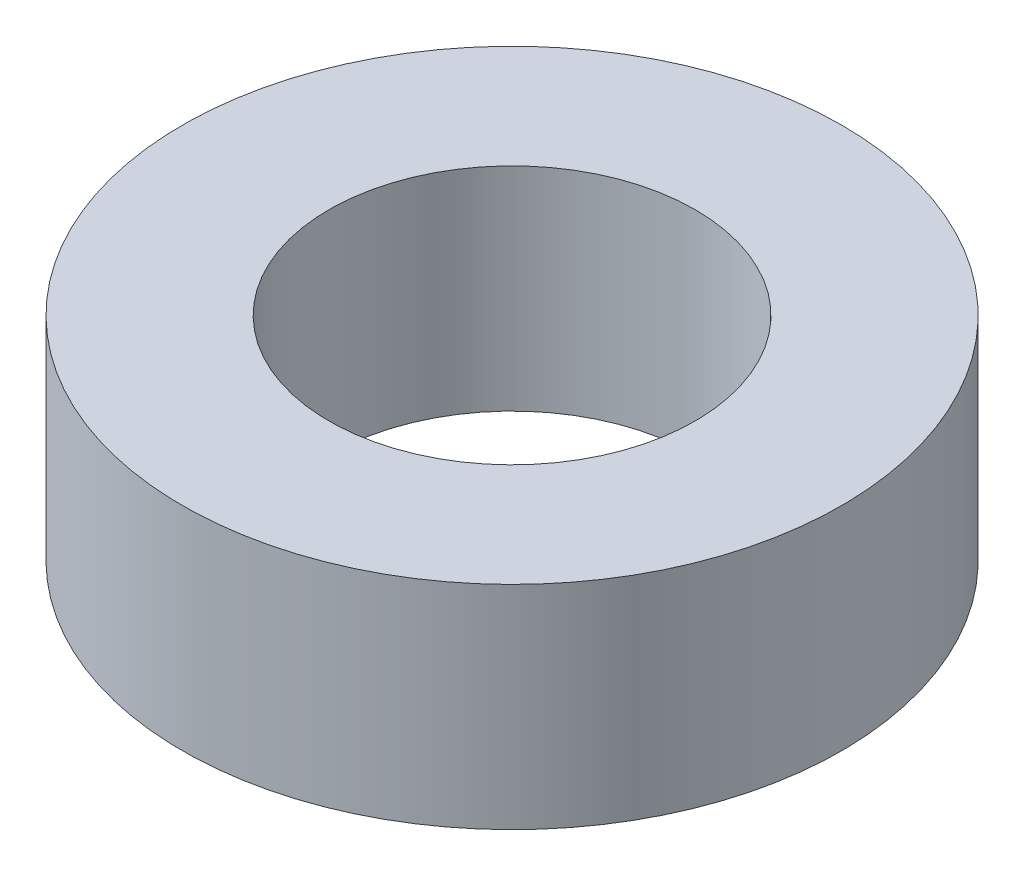
ISO-10303-21;
HEADER;
FILE_DESCRIPTION(('STEP AP214'),'2;1');
FILE_NAME('part.step','',(''),(''),'','','');
FILE_SCHEMA(('AUTOMOTIVE_DESIGN { 1 0 10303 214 1 1 1 1 }'));
ENDSEC;
DATA;
#1=APPLICATION_CONTEXT('core data for automotive mechanical design processes');
#2=APPLICATION_PROTOCOL_DEFINITION('international standard','automotive_design',2000,#1);
#3=PRODUCT_CONTEXT('',#1,'mechanical');
#4=PRODUCT('Part','Part','',(#3));
#5=PRODUCT_RELATED_PRODUCT_CATEGORY('part','',(#4));
#6=PRODUCT_DEFINITION_FORMATION('','',#4);
#7=PRODUCT_DEFINITION_CONTEXT('part definition',#1,'design');
#8=PRODUCT_DEFINITION('design','',#6,#7);
#9=PRODUCT_DEFINITION_SHAPE('','',#8);
#10=(LENGTH_UNIT() NAMED_UNIT(*) SI_UNIT(.MILLI.,.METRE.));
#11=(NAMED_UNIT(*) PLANE_ANGLE_UNIT() SI_UNIT($,.RADIAN.));
#12=(NAMED_UNIT(*) SI_UNIT($,.STERADIAN.) SOLID_ANGLE_UNIT());
#13=UNCERTAINTY_MEASURE_WITH_UNIT(LENGTH_MEASURE(1.E-05),#10,'distance_accuracy_value','');
#14=(GEOMETRIC_REPRESENTATION_CONTEXT(3) GLOBAL_UNCERTAINTY_ASSIGNED_CONTEXT((#13)) GLOBAL_UNIT_ASSIGNED_CONTEXT((#10,
#11,#12)) REPRESENTATION_CONTEXT('',''));
#15=CARTESIAN_POINT('',(0.,0.,0.));
#16=DIRECTION('',(0.,0.,1.));
#17=DIRECTION('',(1.,0.,0.));
#18=AXIS2_PLACEMENT_3D('',#15,#16,#17);
#19=CARTESIAN_POINT('',(0.,29.,0.));
#20=DIRECTION('',(0.,-1.,0.));
#21=DIRECTION('',(0.,0.,-1.));
#22=AXIS2_PLACEMENT_3D('',#19,#20,#21);
#23=CYLINDRICAL_SURFACE('',#22,45.);
#24=CARTESIAN_POINT('',(0.,29.,0.));
#25=DIRECTION('',(0.,1.,0.));
#26=DIRECTION('',(0.,0.,1.));
#27=AXIS2_PLACEMENT_3D('',#24,#25,#26);
#28=CIRCLE('',#27,45.);
#29=CARTESIAN_POINT('',(0.,29.,-45.));
#30=VERTEX_POINT('',#29);
#31=EDGE_CURVE('E10',#30,#30,#28,.T.);
#32=CARTESIAN_POINT('',(0.,0.,0.));
#33=DIRECTION('',(0.,1.,0.));
#34=DIRECTION('',(0.,0.,1.));
#35=AXIS2_PLACEMENT_3D('',#32,#33,#34);
#36=CIRCLE('',#35,45.);
#37=CARTESIAN_POINT('',(0.,0.,-45.));
#38=VERTEX_POINT('',#37);
#39=EDGE_CURVE('E37',#38,#38,#36,.T.);
#40=CARTESIAN_POINT('',(0.,29.,-45.));
#41=CARTESIAN_POINT('',(0.,28.6979166666667,-45.));
#42=CARTESIAN_POINT('',(0.,28.3958333333333,-45.));
#43=CARTESIAN_POINT('',(0.,27.7916666666667,-45.));
#44=CARTESIAN_POINT('',(0.,27.4895833333333,-45.));
#45=CARTESIAN_POINT('',(0.,26.8854166666667,-45.));
#46=CARTESIAN_POINT('',(0.,26.5833333333333,-45.));
#47=CARTESIAN_POINT('',(0.,25.9791666666667,-45.));
#48=CARTESIAN_POINT('',(0.,25.6770833333333,-45.));
#49=CARTESIAN_POINT('',(0.,25.0729166666667,-45.));
#50=CARTESIAN_POINT('',(0.,24.7708333333333,-45.));
#51=CARTESIAN_POINT('',(0.,24.1666666666667,-45.));
#52=CARTESIAN_POINT('',(0.,23.8645833333333,-45.));
#53=CARTESIAN_POINT('',(0.,23.2604166666667,-45.));
#54=CARTESIAN_POINT('',(0.,22.9583333333333,-45.));
#55=CARTESIAN_POINT('',(0.,22.3541666666667,-45.));
#56=CARTESIAN_POINT('',(0.,22.0520833333333,-45.));
#57=CARTESIAN_POINT('',(0.,21.4479166666667,-45.));
#58=CARTESIAN_POINT('',(0.,21.1458333333333,-45.));
#59=CARTESIAN_POINT('',(0.,20.5416666666667,-45.));
#60=CARTESIAN_POINT('',(0.,20.2395833333333,-45.));
#61=CARTESIAN_POINT('',(0.,19.6354166666667,-45.));
#62=CARTESIAN_POINT('',(0.,19.3333333333333,-45.));
#63=CARTESIAN_POINT('',(0.,18.7291666666667,-45.));
#64=CARTESIAN_POINT('',(0.,18.4270833333333,-45.));
#65=CARTESIAN_POINT('',(0.,17.8229166666667,-45.));
#66=CARTESIAN_POINT('',(0.,17.5208333333333,-45.));
#67=CARTESIAN_POINT('',(0.,16.9166666666667,-45.));
#68=CARTESIAN_POINT('',(0.,16.6145833333333,-45.));
#69=CARTESIAN_POINT('',(0.,16.0104166666667,-45.));
#70=CARTESIAN_POINT('',(0.,15.7083333333333,-45.));
#71=CARTESIAN_POINT('',(0.,15.1041666666667,-45.));
#72=CARTESIAN_POINT('',(0.,14.8020833333333,-45.));
#73=CARTESIAN_POINT('',(0.,14.1979166666667,-45.));
#74=CARTESIAN_POINT('',(0.,13.8958333333333,-45.));
#75=CARTESIAN_POINT('',(0.,13.2916666666667,-45.));
#76=CARTESIAN_POINT('',(0.,12.9895833333333,-45.));
#77=CARTESIAN_POINT('',(0.,12.3854166666667,-45.));
#78=CARTESIAN_POINT('',(0.,12.0833333333333,-45.));
#79=CARTESIAN_POINT('',(0.,11.4791666666667,-45.));
#80=CARTESIAN_POINT('',(0.,11.1770833333333,-45.));
#81=CARTESIAN_POINT('',(0.,10.5729166666667,-45.));
#82=CARTESIAN_POINT('',(0.,10.2708333333333,-45.));
#83=CARTESIAN_POINT('',(0.,9.66666666666667,-45.));
#84=CARTESIAN_POINT('',(0.,9.36458333333333,-45.));
#85=CARTESIAN_POINT('',(0.,8.76041666666667,-45.));
#86=CARTESIAN_POINT('',(0.,8.45833333333333,-45.));
#87=CARTESIAN_POINT('',(0.,7.85416666666667,-45.));
#88=CARTESIAN_POINT('',(0.,7.55208333333333,-45.));
#89=CARTESIAN_POINT('',(0.,6.94791666666667,-45.));
#90=CARTESIAN_POINT('',(0.,6.64583333333333,-45.));
#91=CARTESIAN_POINT('',(0.,6.04166666666667,-45.));
#92=CARTESIAN_POINT('',(0.,5.73958333333333,-45.));
#93=CARTESIAN_POINT('',(0.,5.13541666666667,-45.));
#94=CARTESIAN_POINT('',(0.,4.83333333333333,-45.));
#95=CARTESIAN_POINT('',(0.,4.22916666666667,-45.));
#96=CARTESIAN_POINT('',(0.,3.92708333333333,-45.));
#97=CARTESIAN_POINT('',(0.,3.32291666666667,-45.));
#98=CARTESIAN_POINT('',(0.,3.02083333333333,-45.));
#99=CARTESIAN_POINT('',(0.,2.41666666666667,-45.));
#100=CARTESIAN_POINT('',(0.,2.11458333333333,-45.));
#101=CARTESIAN_POINT('',(0.,1.51041666666667,-45.));
#102=CARTESIAN_POINT('',(0.,1.20833333333333,-45.));
#103=CARTESIAN_POINT('',(0.,0.604166666666667,-45.));
#104=CARTESIAN_POINT('',(0.,0.302083333333333,-45.));
#105=CARTESIAN_POINT('',(0.,0.,-45.));
#106=B_SPLINE_CURVE_WITH_KNOTS('',3,(#40,#41,#42,#43,#44,#45,#46,#47,#48,#49,#50,#51,#52,#53,
#54,#55,#56,#57,#58,#59,#60,#61,#62,#63,#64,#65,#66,#67,#68,#69,#70,#71,#72,#73,#74,#75,#76,#77,
#78,#79,#80,#81,#82,#83,#84,#85,#86,#87,#88,#89,#90,#91,#92,#93,#94,#95,#96,#97,#98,#99,#100,
#101,#102,#103,#104,#105),.UNSPECIFIED.,.F.,.F.,(4,2,2,2,2,2,2,2,2,2,2,2,2,2,2,2,2,2,2,2,2,2,2,
2,2,2,2,2,2,2,2,2,4),(0.,0.906249999999997,1.8125,2.71875,3.625,4.53125,5.4375,6.34375,7.25,
8.15625,9.0625,9.96875,10.875,11.78125,12.6875,13.59375,14.5,15.40625,16.3125,17.21875,18.125,
19.03125,19.9375,20.84375,21.75,22.65625,23.5625,24.46875,25.375,26.28125,27.1875,28.09375,29.),.UNSPECIFIED.);
#107=EDGE_CURVE('BSEAM40',#30,#38,#106,.T.);
#108=ORIENTED_EDGE('',*,*,#31,.F.);
#109=ORIENTED_EDGE('',*,*,#39,.T.);
#110=ORIENTED_EDGE('',*,*,#107,.T.);
#111=ORIENTED_EDGE('',*,*,#107,.F.);
#112=EDGE_LOOP('',(#108,#110,#109,#111));
#113=FACE_BOUND('',#112,.T.);
#114=ADVANCED_FACE('F40',(#113),#23,.T.);
#115=CARTESIAN_POINT('',(0.,29.,0.));
#116=DIRECTION('',(0.,1.,0.));
#117=DIRECTION('',(0.,0.,1.));
#118=AXIS2_PLACEMENT_3D('',#115,#116,#117);
#119=PLANE('',#118);
#120=CARTESIAN_POINT('',(0.,29.,0.));
#121=DIRECTION('',(0.,1.,0.));
#122=DIRECTION('',(0.,0.,1.));
#123=AXIS2_PLACEMENT_3D('',#120,#121,#122);
#124=CIRCLE('',#123,25.);
#125=CARTESIAN_POINT('',(0.,29.,-25.));
#126=VERTEX_POINT('',#125);
#127=EDGE_CURVE('E50',#126,#126,#124,.T.);
#128=ORIENTED_EDGE('',*,*,#127,.F.);
#129=EDGE_LOOP('',(#128));
#130=FACE_BOUND('',#129,.T.);
#131=ORIENTED_EDGE('',*,*,#31,.T.);
#132=EDGE_LOOP('',(#131));
#133=FACE_BOUND('',#132,.T.);
#134=ADVANCED_FACE('F59',(#130,#133),#119,.T.);
#135=CARTESIAN_POINT('',(0.,0.,0.));
#136=DIRECTION('',(0.,1.,0.));
#137=DIRECTION('',(0.,0.,1.));
#138=AXIS2_PLACEMENT_3D('',#135,#136,#137);
#139=PLANE('',#138);
#140=CARTESIAN_POINT('',(0.,0.,0.));
#141=DIRECTION('',(0.,1.,0.));
#142=DIRECTION('',(0.,0.,1.));
#143=AXIS2_PLACEMENT_3D('',#140,#141,#142);
#144=CIRCLE('',#143,25.);
#145=CARTESIAN_POINT('',(0.,0.,-25.));
#146=VERTEX_POINT('',#145);
#147=EDGE_CURVE('E47',#146,#146,#144,.T.);
#148=ORIENTED_EDGE('',*,*,#147,.T.);
#149=EDGE_LOOP('',(#148));
#150=FACE_BOUND('',#149,.T.);
#151=ORIENTED_EDGE('',*,*,#39,.F.);
#152=EDGE_LOOP('',(#151));
#153=FACE_BOUND('',#152,.T.);
#154=ADVANCED_FACE('F58',(#150,#153),#139,.F.);
#155=CARTESIAN_POINT('',(0.,29.,0.));
#156=DIRECTION('',(0.,-1.,0.));
#157=DIRECTION('',(0.,0.,-1.));
#158=AXIS2_PLACEMENT_3D('',#155,#156,#157);
#159=CYLINDRICAL_SURFACE('',#158,25.);
#160=CARTESIAN_POINT('',(0.,29.,-25.));
#161=CARTESIAN_POINT('',(0.,28.6979166666667,-25.));
#162=CARTESIAN_POINT('',(0.,28.3958333333333,-25.));
#163=CARTESIAN_POINT('',(0.,27.7916666666667,-25.));
#164=CARTESIAN_POINT('',(0.,27.4895833333333,-25.));
#165=CARTESIAN_POINT('',(0.,26.8854166666667,-25.));
#166=CARTESIAN_POINT('',(0.,26.5833333333333,-25.));
#167=CARTESIAN_POINT('',(0.,25.9791666666667,-25.));
#168=CARTESIAN_POINT('',(0.,25.6770833333333,-25.));
#169=CARTESIAN_POINT('',(0.,25.0729166666667,-25.));
#170=CARTESIAN_POINT('',(0.,24.7708333333333,-25.));
#171=CARTESIAN_POINT('',(0.,24.1666666666667,-25.));
#172=CARTESIAN_POINT('',(0.,23.8645833333333,-25.));
#173=CARTESIAN_POINT('',(0.,23.2604166666667,-25.));
#174=CARTESIAN_POINT('',(0.,22.9583333333333,-25.));
#175=CARTESIAN_POINT('',(0.,22.3541666666667,-25.));
#176=CARTESIAN_POINT('',(0.,22.0520833333333,-25.));
#177=CARTESIAN_POINT('',(0.,21.4479166666667,-25.));
#178=CARTESIAN_POINT('',(0.,21.1458333333333,-25.));
#179=CARTESIAN_POINT('',(0.,20.5416666666667,-25.));
#180=CARTESIAN_POINT('',(0.,20.2395833333333,-25.));
#181=CARTESIAN_POINT('',(0.,19.6354166666667,-25.));
#182=CARTESIAN_POINT('',(0.,19.3333333333333,-25.));
#183=CARTESIAN_POINT('',(0.,18.7291666666667,-25.));
#184=CARTESIAN_POINT('',(0.,18.4270833333333,-25.));
#185=CARTESIAN_POINT('',(0.,17.8229166666667,-25.));
#186=CARTESIAN_POINT('',(0.,17.5208333333333,-25.));
#187=CARTESIAN_POINT('',(0.,16.9166666666667,-25.));
#188=CARTESIAN_POINT('',(0.,16.6145833333333,-25.));
#189=CARTESIAN_POINT('',(0.,16.0104166666667,-25.));
#190=CARTESIAN_POINT('',(0.,15.7083333333333,-25.));
#191=CARTESIAN_POINT('',(0.,15.1041666666667,-25.));
#192=CARTESIAN_POINT('',(0.,14.8020833333333,-25.));
#193=CARTESIAN_POINT('',(0.,14.1979166666667,-25.));
#194=CARTESIAN_POINT('',(0.,13.8958333333333,-25.));
#195=CARTESIAN_POINT('',(0.,13.2916666666667,-25.));
#196=CARTESIAN_POINT('',(0.,12.9895833333333,-25.));
#197=CARTESIAN_POINT('',(0.,12.3854166666667,-25.));
#198=CARTESIAN_POINT('',(0.,12.0833333333333,-25.));
#199=CARTESIAN_POINT('',(0.,11.4791666666667,-25.));
#200=CARTESIAN_POINT('',(0.,11.1770833333333,-25.));
#201=CARTESIAN_POINT('',(0.,10.5729166666667,-25.));
#202=CARTESIAN_POINT('',(0.,10.2708333333333,-25.));
#203=CARTESIAN_POINT('',(0.,9.66666666666667,-25.));
#204=CARTESIAN_POINT('',(0.,9.36458333333333,-25.));
#205=CARTESIAN_POINT('',(0.,8.76041666666667,-25.));
#206=CARTESIAN_POINT('',(0.,8.45833333333333,-25.));
#207=CARTESIAN_POINT('',(0.,7.85416666666667,-25.));
#208=CARTESIAN_POINT('',(0.,7.55208333333333,-25.));
#209=CARTESIAN_POINT('',(0.,6.94791666666667,-25.));
#210=CARTESIAN_POINT('',(0.,6.64583333333333,-25.));
#211=CARTESIAN_POINT('',(0.,6.04166666666667,-25.));
#212=CARTESIAN_POINT('',(0.,5.73958333333333,-25.));
#213=CARTESIAN_POINT('',(0.,5.13541666666667,-25.));
#214=CARTESIAN_POINT('',(0.,4.83333333333333,-25.));
#215=CARTESIAN_POINT('',(0.,4.22916666666667,-25.));
#216=CARTESIAN_POINT('',(0.,3.92708333333333,-25.));
#217=CARTESIAN_POINT('',(0.,3.32291666666667,-25.));
#218=CARTESIAN_POINT('',(0.,3.02083333333333,-25.));
#219=CARTESIAN_POINT('',(0.,2.41666666666667,-25.));
#220=CARTESIAN_POINT('',(0.,2.11458333333333,-25.));
#221=CARTESIAN_POINT('',(0.,1.51041666666667,-25.));
#222=CARTESIAN_POINT('',(0.,1.20833333333333,-25.));
#223=CARTESIAN_POINT('',(0.,0.604166666666667,-25.));
#224=CARTESIAN_POINT('',(0.,0.302083333333333,-25.));
#225=CARTESIAN_POINT('',(0.,0.,-25.));
#226=B_SPLINE_CURVE_WITH_KNOTS('',3,(#160,#161,#162,#163,#164,#165,#166,#167,#168,#169,#170,
#171,#172,#173,#174,#175,#176,#177,#178,#179,#180,#181,#182,#183,#184,#185,#186,#187,#188,#189,
#190,#191,#192,#193,#194,#195,#196,#197,#198,#199,#200,#201,#202,#203,#204,#205,#206,#207,#208,
#209,#210,#211,#212,#213,#214,#215,#216,#217,#218,#219,#220,#221,#222,#223,#224,#225),
.UNSPECIFIED.,.F.,.F.,(4,2,2,2,2,2,2,2,2,2,2,2,2,2,2,2,2,2,2,2,2,2,2,2,2,2,2,2,2,2,2,2,4),(0.,
0.906249999999997,1.8125,2.71875,3.625,4.53125,5.4375,6.34375,7.25,8.15625,9.0625,9.96875,
10.875,11.78125,12.6875,13.59375,14.5,15.40625,16.3125,17.21875,18.125,19.03125,19.9375,
20.84375,21.75,22.65625,23.5625,24.46875,25.375,26.28125,27.1875,28.09375,29.),.UNSPECIFIED.);
#227=EDGE_CURVE('BSEAM54',#126,#146,#226,.T.);
#228=ORIENTED_EDGE('',*,*,#127,.T.);
#229=ORIENTED_EDGE('',*,*,#147,.F.);
#230=ORIENTED_EDGE('',*,*,#227,.T.);
#231=ORIENTED_EDGE('',*,*,#227,.F.);
#232=EDGE_LOOP('',(#228,#230,#229,#231));
#233=FACE_BOUND('',#232,.T.);
#234=ADVANCED_FACE('F54',(#233),#159,.F.);
#235=CLOSED_SHELL('',(#114,#134,#154,#234));
#236=MANIFOLD_SOLID_BREP('B2',#235);
#237=ADVANCED_BREP_SHAPE_REPRESENTATION('',(#18,#236),#14);
#238=SHAPE_DEFINITION_REPRESENTATION(#9,#237);
ENDSEC;
END-ISO-10303-21;
